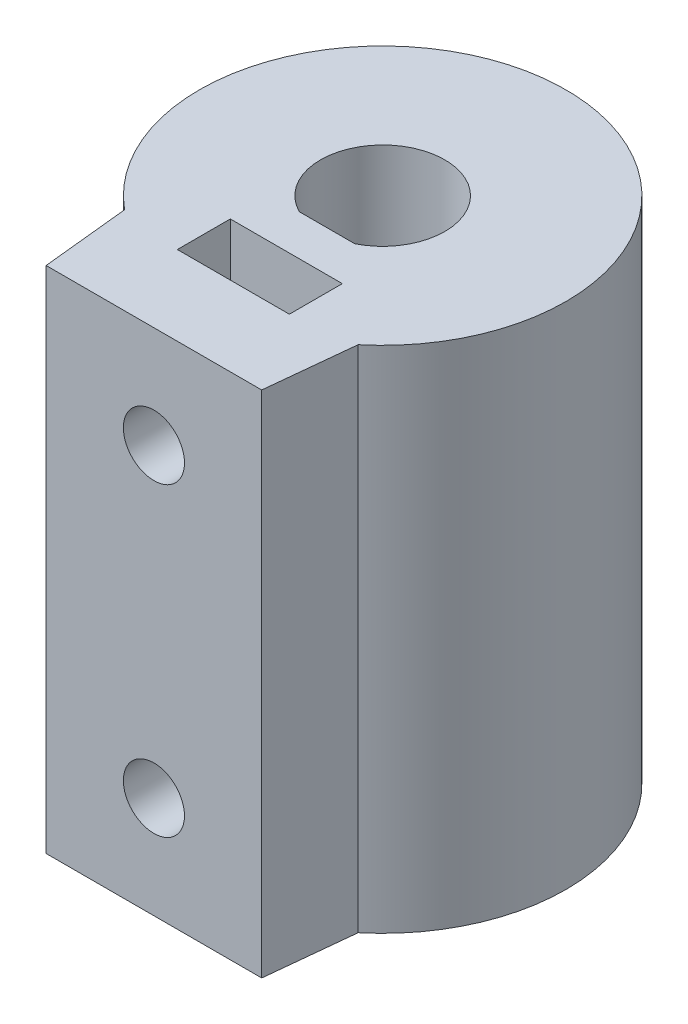
ISO-10303-21;
HEADER;
FILE_DESCRIPTION(('STEP AP214'),'2;1');
FILE_NAME('part.step','',(''),(''),'','','');
FILE_SCHEMA(('AUTOMOTIVE_DESIGN { 1 0 10303 214 1 1 1 1 }'));
ENDSEC;
DATA;
#1=APPLICATION_CONTEXT('core data for automotive mechanical design processes');
#2=APPLICATION_PROTOCOL_DEFINITION('international standard','automotive_design',2000,#1);
#3=PRODUCT_CONTEXT('',#1,'mechanical');
#4=PRODUCT('Part','Part','',(#3));
#5=PRODUCT_RELATED_PRODUCT_CATEGORY('part','',(#4));
#6=PRODUCT_DEFINITION_FORMATION('','',#4);
#7=PRODUCT_DEFINITION_CONTEXT('part definition',#1,'design');
#8=PRODUCT_DEFINITION('design','',#6,#7);
#9=PRODUCT_DEFINITION_SHAPE('','',#8);
#10=(LENGTH_UNIT() NAMED_UNIT(*) SI_UNIT(.MILLI.,.METRE.));
#11=(NAMED_UNIT(*) PLANE_ANGLE_UNIT() SI_UNIT($,.RADIAN.));
#12=(NAMED_UNIT(*) SI_UNIT($,.STERADIAN.) SOLID_ANGLE_UNIT());
#13=UNCERTAINTY_MEASURE_WITH_UNIT(LENGTH_MEASURE(1.E-05),#10,'distance_accuracy_value','');
#14=(GEOMETRIC_REPRESENTATION_CONTEXT(3) GLOBAL_UNCERTAINTY_ASSIGNED_CONTEXT((#13)) GLOBAL_UNIT_ASSIGNED_CONTEXT((#10,
#11,#12)) REPRESENTATION_CONTEXT('',''));
#15=CARTESIAN_POINT('',(0.,0.,0.));
#16=DIRECTION('',(0.,0.,1.));
#17=DIRECTION('',(1.,0.,0.));
#18=AXIS2_PLACEMENT_3D('',#15,#16,#17);
#19=CARTESIAN_POINT('',(0.,20.,-0.770000000000002));
#20=DIRECTION('',(0.,0.,1.));
#21=DIRECTION('',(1.,0.,0.));
#22=AXIS2_PLACEMENT_3D('',#19,#20,#21);
#23=CYLINDRICAL_SURFACE('',#22,1.5);
#24=CARTESIAN_POINT('',(0.,20.,4.73));
#25=DIRECTION('',(0.,0.,1.));
#26=DIRECTION('',(1.,0.,0.));
#27=AXIS2_PLACEMENT_3D('',#24,#25,#26);
#28=CIRCLE('',#27,1.5);
#29=CARTESIAN_POINT('',(1.5,20.,4.73));
#30=VERTEX_POINT('',#29);
#31=EDGE_CURVE('E347',#30,#30,#28,.T.);
#32=ORIENTED_EDGE('',*,*,#31,.T.);
#33=EDGE_LOOP('',(#32));
#34=FACE_BOUND('',#33,.T.);
#35=CARTESIAN_POINT('',(0.,20.,2.73));
#36=DIRECTION('',(0.,0.,-1.));
#37=DIRECTION('',(-1.,0.,0.));
#38=AXIS2_PLACEMENT_3D('',#35,#36,#37);
#39=CIRCLE('',#38,1.5);
#40=CARTESIAN_POINT('',(-1.36,19.3672283192177,2.73));
#41=VERTEX_POINT('',#40);
#42=CARTESIAN_POINT('',(1.36,19.3672283192177,2.73));
#43=VERTEX_POINT('',#42);
#44=EDGE_CURVE('E256',#41,#43,#39,.F.);
#45=ORIENTED_EDGE('',*,*,#44,.F.);
#46=CARTESIAN_POINT('',(-1.36,20.6327716807823,2.73));
#47=CARTESIAN_POINT('',(-1.37582693202637,20.5987516826467,2.72211426512571));
#48=CARTESIAN_POINT('',(-1.39041402763153,20.5640632935865,2.71467722365243));
#49=CARTESIAN_POINT('',(-1.41700490797706,20.4934805228224,2.70089282276826));
#50=CARTESIAN_POINT('',(-1.42900735559939,20.4575855279516,2.69454602771726));
#51=CARTESIAN_POINT('',(-1.46090336135237,20.3485325620071,2.67747143825815));
#52=CARTESIAN_POINT('',(-1.47677007370152,20.2738258520041,2.66866585744207));
#53=CARTESIAN_POINT('',(-1.49698728644416,20.1221126237164,2.657380257011));
#54=CARTESIAN_POINT('',(-1.50129267716343,20.0450982790909,2.65492501636061));
#55=CARTESIAN_POINT('',(-1.49803519614687,19.8914012459497,2.65676325665299));
#56=CARTESIAN_POINT('',(-1.49047482935579,19.8147184908599,2.66105531319426));
#57=CARTESIAN_POINT('',(-1.4657649565435,19.6746350688783,2.67473430540776));
#58=CARTESIAN_POINT('',(-1.45011016050553,19.6108807315012,2.68332165663147));
#59=CARTESIAN_POINT('',(-1.41086990654606,19.4864603830018,2.70414463478998));
#60=CARTESIAN_POINT('',(-1.38728303426965,19.425794924875,2.71638091231448));
#61=CARTESIAN_POINT('',(-1.36,19.3672283192177,2.73));
#62=B_SPLINE_CURVE_WITH_KNOTS('',3,(#46,#47,#48,#49,#50,#51,#52,#53,#54,#55,#56,#57,#58,#59,#60,
#61),.UNSPECIFIED.,.F.,.F.,(4,2,2,2,2,2,2,4),(0.,0.114968269489344,0.229995873478572,
0.459445569286955,0.689789234119177,0.920084278326595,1.11805841082691,1.31606786248918),.UNSPECIFIED.);
#63=CARTESIAN_POINT('',(-1.36,20.6327716807823,2.73));
#64=VERTEX_POINT('',#63);
#65=EDGE_CURVE('E220',#64,#41,#62,.T.);
#66=ORIENTED_EDGE('',*,*,#65,.F.);
#67=CARTESIAN_POINT('',(1.36,20.6327716807823,2.73));
#68=VERTEX_POINT('',#67);
#69=EDGE_CURVE('E230',#68,#64,#39,.F.);
#70=ORIENTED_EDGE('',*,*,#69,.F.);
#71=CARTESIAN_POINT('',(1.36,19.3672283192177,2.73));
#72=CARTESIAN_POINT('',(1.37582693202637,19.4012483173533,2.72211426512571));
#73=CARTESIAN_POINT('',(1.39041402763153,19.4359367064135,2.71467722365243));
#74=CARTESIAN_POINT('',(1.41700490797706,19.5065194771776,2.70089282276826));
#75=CARTESIAN_POINT('',(1.42900735559939,19.5424144720484,2.69454602771726));
#76=CARTESIAN_POINT('',(1.46090336135237,19.6514674379929,2.67747143825815));
#77=CARTESIAN_POINT('',(1.47677007370153,19.7261741479959,2.66866585744207));
#78=CARTESIAN_POINT('',(1.49698728644416,19.8778873762836,2.657380257011));
#79=CARTESIAN_POINT('',(1.50129267716343,19.9549017209091,2.65492501636061));
#80=CARTESIAN_POINT('',(1.49803519614687,20.1085987540503,2.65676325665299));
#81=CARTESIAN_POINT('',(1.49047482935579,20.1852815091401,2.66105531319426));
#82=CARTESIAN_POINT('',(1.4657649565435,20.3253649311217,2.67473430540776));
#83=CARTESIAN_POINT('',(1.45011016050552,20.3891192684988,2.68332165663147));
#84=CARTESIAN_POINT('',(1.41086990654606,20.5135396169982,2.70414463478998));
#85=CARTESIAN_POINT('',(1.38728303426965,20.574205075125,2.71638091231448));
#86=CARTESIAN_POINT('',(1.36,20.6327716807823,2.73));
#87=B_SPLINE_CURVE_WITH_KNOTS('',3,(#71,#72,#73,#74,#75,#76,#77,#78,#79,#80,#81,#82,#83,#84,#85,
#86),.UNSPECIFIED.,.F.,.F.,(4,2,2,2,2,2,2,4),(0.,0.114968269489344,0.229995873478572,
0.459445569286962,0.689789234119187,0.920084278326605,1.11805841082692,1.31606786248917),.UNSPECIFIED.);
#88=EDGE_CURVE('E249',#43,#68,#87,.T.);
#89=ORIENTED_EDGE('',*,*,#88,.F.);
#90=EDGE_LOOP('',(#45,#66,#70,#89));
#91=FACE_BOUND('',#90,.T.);
#92=ADVANCED_FACE('F37',(#34,#91),#23,.F.);
#93=CARTESIAN_POINT('',(0.,25.,0.));
#94=DIRECTION('',(0.,1.,0.));
#95=DIRECTION('',(0.,0.,1.));
#96=AXIS2_PLACEMENT_3D('',#93,#94,#95);
#97=PLANE('',#96);
#98=DIRECTION('',(-1.,0.,0.));
#99=VECTOR('',#98,1.);
#100=CARTESIAN_POINT('',(-5.25,25.,11.23));
#101=LINE('',#100,#99);
#102=CARTESIAN_POINT('',(5.29182838670146,25.,11.23));
#103=VERTEX_POINT('',#102);
#104=CARTESIAN_POINT('',(-5.29182838670146,25.,11.23));
#105=VERTEX_POINT('',#104);
#106=EDGE_CURVE('E51',#103,#105,#101,.T.);
#107=ORIENTED_EDGE('',*,*,#106,.F.);
#108=DIRECTION('',(0.102499756623053,0.,-0.994733029456756));
#109=VECTOR('',#108,1.);
#110=CARTESIAN_POINT('',(5.73421329875905,25.,6.93677142800127));
#111=LINE('',#110,#109);
#112=CARTESIAN_POINT('',(5.73421329875905,25.,6.93677142800127));
#113=VERTEX_POINT('',#112);
#114=EDGE_CURVE('E11',#103,#113,#111,.T.);
#115=ORIENTED_EDGE('',*,*,#114,.T.);
#116=CARTESIAN_POINT('',(0.,25.,0.));
#117=DIRECTION('',(0.,1.,0.));
#118=DIRECTION('',(0.,0.,-1.));
#119=AXIS2_PLACEMENT_3D('',#116,#117,#118);
#120=CIRCLE('',#119,9.);
#121=CARTESIAN_POINT('',(-5.73421329875905,25.,6.93677142800127));
#122=VERTEX_POINT('',#121);
#123=EDGE_CURVE('E409',#113,#122,#120,.T.);
#124=ORIENTED_EDGE('',*,*,#123,.T.);
#125=DIRECTION('',(0.102499756623053,0.,0.994733029456756));
#126=VECTOR('',#125,1.);
#127=CARTESIAN_POINT('',(-5.25,25.,11.6359334303968));
#128=LINE('',#127,#126);
#129=EDGE_CURVE('E393',#122,#105,#128,.T.);
#130=ORIENTED_EDGE('',*,*,#129,.T.);
#131=EDGE_LOOP('',(#107,#115,#124,#130));
#132=FACE_BOUND('',#131,.T.);
#133=CARTESIAN_POINT('',(0.,25.,0.));
#134=DIRECTION('',(0.,1.,0.));
#135=DIRECTION('',(0.,0.,1.));
#136=AXIS2_PLACEMENT_3D('',#133,#134,#135);
#137=CIRCLE('',#136,3.05);
#138=CARTESIAN_POINT('',(1.36,25.,2.73));
#139=VERTEX_POINT('',#138);
#140=CARTESIAN_POINT('',(-1.36,25.,2.73));
#141=VERTEX_POINT('',#140);
#142=EDGE_CURVE('E365',#139,#141,#137,.T.);
#143=ORIENTED_EDGE('',*,*,#142,.F.);
#144=DIRECTION('',(1.,0.,0.));
#145=VECTOR('',#144,1.);
#146=CARTESIAN_POINT('',(-5.25,25.,2.73));
#147=LINE('',#146,#145);
#148=EDGE_CURVE('E517',#141,#139,#147,.T.);
#149=ORIENTED_EDGE('',*,*,#148,.F.);
#150=EDGE_LOOP('',(#143,#149));
#151=FACE_BOUND('',#150,.T.);
#152=DIRECTION('',(-1.,0.,0.));
#153=VECTOR('',#152,1.);
#154=CARTESIAN_POINT('',(-2.75,25.,7.33));
#155=LINE('',#154,#153);
#156=CARTESIAN_POINT('',(2.75,25.,7.33));
#157=VERTEX_POINT('',#156);
#158=CARTESIAN_POINT('',(-2.75,25.,7.33));
#159=VERTEX_POINT('',#158);
#160=EDGE_CURVE('E178',#157,#159,#155,.T.);
#161=ORIENTED_EDGE('',*,*,#160,.T.);
#162=DIRECTION('',(0.,0.,-1.));
#163=VECTOR('',#162,1.);
#164=CARTESIAN_POINT('',(-2.75,25.,7.33));
#165=LINE('',#164,#163);
#166=CARTESIAN_POINT('',(-2.75,25.,4.73));
#167=VERTEX_POINT('',#166);
#168=EDGE_CURVE('E190',#159,#167,#165,.T.);
#169=ORIENTED_EDGE('',*,*,#168,.T.);
#170=DIRECTION('',(1.,0.,0.));
#171=VECTOR('',#170,1.);
#172=CARTESIAN_POINT('',(-2.75,25.,4.73));
#173=LINE('',#172,#171);
#174=CARTESIAN_POINT('',(2.75,25.,4.73));
#175=VERTEX_POINT('',#174);
#176=EDGE_CURVE('E215',#167,#175,#173,.T.);
#177=ORIENTED_EDGE('',*,*,#176,.T.);
#178=DIRECTION('',(0.,0.,1.));
#179=VECTOR('',#178,1.);
#180=CARTESIAN_POINT('',(2.75,25.,7.33));
#181=LINE('',#180,#179);
#182=EDGE_CURVE('E213',#175,#157,#181,.T.);
#183=ORIENTED_EDGE('',*,*,#182,.T.);
#184=EDGE_LOOP('',(#161,#169,#177,#183));
#185=FACE_BOUND('',#184,.T.);
#186=ADVANCED_FACE('F242',(#132,#151,#185),#97,.T.);
#187=CARTESIAN_POINT('',(0.,20.,7.33));
#188=DIRECTION('',(0.,0.,-1.));
#189=DIRECTION('',(-1.,0.,0.));
#190=AXIS2_PLACEMENT_3D('',#187,#188,#189);
#191=CIRCLE('',#190,1.5);
#192=CARTESIAN_POINT('',(-1.5,20.,7.33));
#193=VERTEX_POINT('',#192);
#194=EDGE_CURVE('E380',#193,#193,#191,.T.);
#195=ORIENTED_EDGE('',*,*,#194,.T.);
#196=EDGE_LOOP('',(#195));
#197=FACE_BOUND('',#196,.T.);
#198=CARTESIAN_POINT('',(0.,20.,11.23));
#199=DIRECTION('',(0.,0.,1.));
#200=DIRECTION('',(1.,0.,0.));
#201=AXIS2_PLACEMENT_3D('',#198,#199,#200);
#202=CIRCLE('',#201,1.5);
#203=CARTESIAN_POINT('',(1.5,20.,11.23));
#204=VERTEX_POINT('',#203);
#205=EDGE_CURVE('E419',#204,#204,#202,.T.);
#206=ORIENTED_EDGE('',*,*,#205,.T.);
#207=EDGE_LOOP('',(#206));
#208=FACE_BOUND('',#207,.T.);
#209=ADVANCED_FACE('F236',(#197,#208),#23,.F.);
#210=CARTESIAN_POINT('',(-2.32904237417776,12.,2.73));
#211=DIRECTION('',(0.,0.,-1.));
#212=DIRECTION('',(-1.,0.,0.));
#213=AXIS2_PLACEMENT_3D('',#210,#211,#212);
#214=PLANE('',#213);
#215=DIRECTION('',(0.,-1.,0.));
#216=VECTOR('',#215,1.);
#217=CARTESIAN_POINT('',(-1.36,25.,2.73));
#218=LINE('',#217,#216);
#219=CARTESIAN_POINT('',(-1.36,5.63277168078226,2.73));
#220=VERTEX_POINT('',#219);
#221=EDGE_CURVE('E356',#220,#41,#218,.F.);
#222=ORIENTED_EDGE('',*,*,#221,.T.);
#223=ORIENTED_EDGE('',*,*,#44,.T.);
#224=DIRECTION('',(0.,-1.,0.));
#225=VECTOR('',#224,1.);
#226=CARTESIAN_POINT('',(1.36,25.,2.73));
#227=LINE('',#226,#225);
#228=CARTESIAN_POINT('',(1.36,5.63277168078226,2.73));
#229=VERTEX_POINT('',#228);
#230=EDGE_CURVE('E374',#43,#229,#227,.T.);
#231=ORIENTED_EDGE('',*,*,#230,.T.);
#232=CARTESIAN_POINT('',(0.,5.,2.73));
#233=DIRECTION('',(0.,0.,-1.));
#234=DIRECTION('',(-1.,0.,0.));
#235=AXIS2_PLACEMENT_3D('',#232,#233,#234);
#236=CIRCLE('',#235,1.5);
#237=EDGE_CURVE('E299',#220,#229,#236,.T.);
#238=ORIENTED_EDGE('',*,*,#237,.F.);
#239=EDGE_LOOP('',(#222,#223,#231,#238));
#240=FACE_BOUND('',#239,.T.);
#241=ADVANCED_FACE('F241',(#240),#214,.T.);
#242=CARTESIAN_POINT('',(0.,25.,0.));
#243=DIRECTION('',(0.,-1.,0.));
#244=DIRECTION('',(0.,0.,-1.));
#245=AXIS2_PLACEMENT_3D('',#242,#243,#244);
#246=CYLINDRICAL_SURFACE('',#245,3.05);
#247=ORIENTED_EDGE('',*,*,#230,.F.);
#248=ORIENTED_EDGE('',*,*,#88,.T.);
#249=EDGE_CURVE('E370',#139,#68,#227,.T.);
#250=ORIENTED_EDGE('',*,*,#249,.F.);
#251=ORIENTED_EDGE('',*,*,#142,.T.);
#252=EDGE_CURVE('E358',#64,#141,#218,.F.);
#253=ORIENTED_EDGE('',*,*,#252,.F.);
#254=ORIENTED_EDGE('',*,*,#65,.T.);
#255=ORIENTED_EDGE('',*,*,#221,.F.);
#256=CARTESIAN_POINT('',(-1.36,4.36722831921774,2.73));
#257=CARTESIAN_POINT('',(-1.37582693202637,4.40124831735328,2.72211426512571));
#258=CARTESIAN_POINT('',(-1.39041402763153,4.43593670641346,2.71467722365243));
#259=CARTESIAN_POINT('',(-1.41700490797706,4.50651947717757,2.70089282276826));
#260=CARTESIAN_POINT('',(-1.42900735559939,4.54241447204839,2.69454602771726));
#261=CARTESIAN_POINT('',(-1.46090336135237,4.65146743799289,2.67747143825815));
#262=CARTESIAN_POINT('',(-1.47677007370152,4.72617414799588,2.66866585744207));
#263=CARTESIAN_POINT('',(-1.49698728644416,4.87788737628362,2.657380257011));
#264=CARTESIAN_POINT('',(-1.50129267716343,4.95490172090914,2.65492501636061));
#265=CARTESIAN_POINT('',(-1.49803519614687,5.10859875405029,2.65676325665299));
#266=CARTESIAN_POINT('',(-1.49047482935579,5.18528150914013,2.66105531319426));
#267=CARTESIAN_POINT('',(-1.4657649565435,5.32536493112172,2.67473430540776));
#268=CARTESIAN_POINT('',(-1.45011016050552,5.38911926849878,2.68332165663147));
#269=CARTESIAN_POINT('',(-1.41086990654606,5.51353961699819,2.70414463478998));
#270=CARTESIAN_POINT('',(-1.38728303426965,5.57420507512498,2.71638091231448));
#271=CARTESIAN_POINT('',(-1.36,5.63277168078226,2.73));
#272=B_SPLINE_CURVE_WITH_KNOTS('',3,(#256,#257,#258,#259,#260,#261,#262,#263,#264,#265,#266,
#267,#268,#269,#270,#271),.UNSPECIFIED.,.F.,.F.,(4,2,2,2,2,2,2,4),(0.,0.114968269489347,
0.229995873478574,0.459445569286958,0.689789234119182,0.920084278326603,1.11805841082691,
1.31606786248917),.UNSPECIFIED.);
#273=CARTESIAN_POINT('',(-1.36,4.36722831921774,2.73));
#274=VERTEX_POINT('',#273);
#275=EDGE_CURVE('E298',#274,#220,#272,.T.);
#276=ORIENTED_EDGE('',*,*,#275,.F.);
#277=CARTESIAN_POINT('',(-1.36,0.,2.73));
#278=VERTEX_POINT('',#277);
#279=EDGE_CURVE('E361',#278,#274,#218,.F.);
#280=ORIENTED_EDGE('',*,*,#279,.F.);
#281=CARTESIAN_POINT('',(0.,0.,0.));
#282=DIRECTION('',(0.,1.,0.));
#283=DIRECTION('',(0.,0.,1.));
#284=AXIS2_PLACEMENT_3D('',#281,#282,#283);
#285=CIRCLE('',#284,3.05);
#286=CARTESIAN_POINT('',(1.36,0.,2.73));
#287=VERTEX_POINT('',#286);
#288=EDGE_CURVE('E368',#287,#278,#285,.T.);
#289=ORIENTED_EDGE('',*,*,#288,.F.);
#290=CARTESIAN_POINT('',(1.36,4.36722831921774,2.73));
#291=VERTEX_POINT('',#290);
#292=EDGE_CURVE('E364',#291,#287,#227,.T.);
#293=ORIENTED_EDGE('',*,*,#292,.F.);
#294=CARTESIAN_POINT('',(1.36,5.63277168078226,2.73));
#295=CARTESIAN_POINT('',(1.37582693202637,5.59875168264672,2.72211426512571));
#296=CARTESIAN_POINT('',(1.39041402763153,5.56406329358655,2.71467722365243));
#297=CARTESIAN_POINT('',(1.41700490797706,5.49348052282243,2.70089282276826));
#298=CARTESIAN_POINT('',(1.42900735559939,5.45758552795162,2.69454602771726));
#299=CARTESIAN_POINT('',(1.46090336135237,5.34853256200711,2.67747143825815));
#300=CARTESIAN_POINT('',(1.47677007370152,5.27382585200412,2.66866585744207));
#301=CARTESIAN_POINT('',(1.49698728644416,5.12211262371638,2.657380257011));
#302=CARTESIAN_POINT('',(1.50129267716343,5.04509827909086,2.65492501636061));
#303=CARTESIAN_POINT('',(1.49803519614687,4.89140124594971,2.65676325665299));
#304=CARTESIAN_POINT('',(1.49047482935579,4.81471849085987,2.66105531319426));
#305=CARTESIAN_POINT('',(1.4657649565435,4.67463506887828,2.67473430540776));
#306=CARTESIAN_POINT('',(1.45011016050552,4.61088073150122,2.68332165663147));
#307=CARTESIAN_POINT('',(1.41086990654606,4.48646038300181,2.70414463478998));
#308=CARTESIAN_POINT('',(1.38728303426965,4.42579492487502,2.71638091231448));
#309=CARTESIAN_POINT('',(1.36,4.36722831921774,2.73));
#310=B_SPLINE_CURVE_WITH_KNOTS('',3,(#294,#295,#296,#297,#298,#299,#300,#301,#302,#303,#304,
#305,#306,#307,#308,#309),.UNSPECIFIED.,.F.,.F.,(4,2,2,2,2,2,2,4),(0.,0.114968269489346,
0.229995873478574,0.459445569286958,0.689789234119184,0.920084278326602,1.11805841082692,
1.31606786248917),.UNSPECIFIED.);
#311=EDGE_CURVE('E305',#229,#291,#310,.T.);
#312=ORIENTED_EDGE('',*,*,#311,.F.);
#313=EDGE_LOOP('',(#247,#248,#250,#251,#253,#254,#255,#276,#280,#289,#293,#312));
#314=FACE_BOUND('',#313,.T.);
#315=ADVANCED_FACE('F232',(#314),#246,.F.);
#316=CARTESIAN_POINT('',(0.,5.,-0.770000000000002));
#317=DIRECTION('',(0.,0.,1.));
#318=DIRECTION('',(1.,0.,0.));
#319=AXIS2_PLACEMENT_3D('',#316,#317,#318);
#320=CYLINDRICAL_SURFACE('',#319,1.5);
#321=CARTESIAN_POINT('',(0.,5.,7.33));
#322=DIRECTION('',(0.,0.,1.));
#323=DIRECTION('',(1.,0.,0.));
#324=AXIS2_PLACEMENT_3D('',#321,#322,#323);
#325=CIRCLE('',#324,1.5);
#326=CARTESIAN_POINT('',(1.5,5.,7.33));
#327=VERTEX_POINT('',#326);
#328=EDGE_CURVE('E377',#327,#327,#325,.F.);
#329=ORIENTED_EDGE('',*,*,#328,.T.);
#330=EDGE_LOOP('',(#329));
#331=FACE_BOUND('',#330,.T.);
#332=CARTESIAN_POINT('',(0.,5.,11.23));
#333=DIRECTION('',(0.,0.,1.));
#334=DIRECTION('',(1.,0.,0.));
#335=AXIS2_PLACEMENT_3D('',#332,#333,#334);
#336=CIRCLE('',#335,1.5);
#337=CARTESIAN_POINT('',(1.5,5.,11.23));
#338=VERTEX_POINT('',#337);
#339=EDGE_CURVE('E415',#338,#338,#336,.T.);
#340=ORIENTED_EDGE('',*,*,#339,.T.);
#341=EDGE_LOOP('',(#340));
#342=FACE_BOUND('',#341,.T.);
#343=ADVANCED_FACE('F315',(#331,#342),#320,.F.);
#344=ORIENTED_EDGE('',*,*,#237,.T.);
#345=ORIENTED_EDGE('',*,*,#311,.T.);
#346=EDGE_CURVE('E291',#291,#274,#236,.T.);
#347=ORIENTED_EDGE('',*,*,#346,.T.);
#348=ORIENTED_EDGE('',*,*,#275,.T.);
#349=EDGE_LOOP('',(#344,#345,#347,#348));
#350=FACE_BOUND('',#349,.T.);
#351=CARTESIAN_POINT('',(0.,5.,4.73));
#352=DIRECTION('',(0.,0.,-1.));
#353=DIRECTION('',(-1.,0.,0.));
#354=AXIS2_PLACEMENT_3D('',#351,#352,#353);
#355=CIRCLE('',#354,1.5);
#356=CARTESIAN_POINT('',(-1.5,5.,4.73));
#357=VERTEX_POINT('',#356);
#358=EDGE_CURVE('E373',#357,#357,#355,.F.);
#359=ORIENTED_EDGE('',*,*,#358,.T.);
#360=EDGE_LOOP('',(#359));
#361=FACE_BOUND('',#360,.T.);
#362=ADVANCED_FACE('F310',(#350,#361),#320,.F.);
#363=ORIENTED_EDGE('',*,*,#249,.T.);
#364=ORIENTED_EDGE('',*,*,#69,.T.);
#365=ORIENTED_EDGE('',*,*,#252,.T.);
#366=ORIENTED_EDGE('',*,*,#148,.T.);
#367=EDGE_LOOP('',(#363,#364,#365,#366));
#368=FACE_BOUND('',#367,.T.);
#369=ADVANCED_FACE('F314',(#368),#214,.T.);
#370=CARTESIAN_POINT('',(0.,0.,0.));
#371=DIRECTION('',(0.,1.,0.));
#372=DIRECTION('',(0.,0.,1.));
#373=AXIS2_PLACEMENT_3D('',#370,#371,#372);
#374=PLANE('',#373);
#375=DIRECTION('',(1.,0.,0.));
#376=VECTOR('',#375,1.);
#377=CARTESIAN_POINT('',(-2.75,0.,4.73));
#378=LINE('',#377,#376);
#379=CARTESIAN_POINT('',(-2.75,0.,4.73));
#380=VERTEX_POINT('',#379);
#381=CARTESIAN_POINT('',(2.75,0.,4.73));
#382=VERTEX_POINT('',#381);
#383=EDGE_CURVE('E279',#380,#382,#378,.T.);
#384=ORIENTED_EDGE('',*,*,#383,.F.);
#385=DIRECTION('',(0.,0.,-1.));
#386=VECTOR('',#385,1.);
#387=CARTESIAN_POINT('',(-2.75,0.,7.33));
#388=LINE('',#387,#386);
#389=CARTESIAN_POINT('',(-2.75,0.,7.33));
#390=VERTEX_POINT('',#389);
#391=EDGE_CURVE('E269',#390,#380,#388,.T.);
#392=ORIENTED_EDGE('',*,*,#391,.F.);
#393=DIRECTION('',(-1.,0.,0.));
#394=VECTOR('',#393,1.);
#395=CARTESIAN_POINT('',(-2.75,0.,7.33));
#396=LINE('',#395,#394);
#397=CARTESIAN_POINT('',(2.75,0.,7.33));
#398=VERTEX_POINT('',#397);
#399=EDGE_CURVE('E285',#398,#390,#396,.T.);
#400=ORIENTED_EDGE('',*,*,#399,.F.);
#401=DIRECTION('',(0.,0.,1.));
#402=VECTOR('',#401,1.);
#403=CARTESIAN_POINT('',(2.75,0.,7.33));
#404=LINE('',#403,#402);
#405=EDGE_CURVE('E282',#382,#398,#404,.T.);
#406=ORIENTED_EDGE('',*,*,#405,.F.);
#407=EDGE_LOOP('',(#384,#392,#400,#406));
#408=FACE_BOUND('',#407,.T.);
#409=DIRECTION('',(1.,0.,0.));
#410=VECTOR('',#409,1.);
#411=CARTESIAN_POINT('',(-5.25,0.,11.23));
#412=LINE('',#411,#410);
#413=CARTESIAN_POINT('',(-5.29182838670146,0.,11.23));
#414=VERTEX_POINT('',#413);
#415=CARTESIAN_POINT('',(5.29182838670146,0.,11.23));
#416=VERTEX_POINT('',#415);
#417=EDGE_CURVE('E200',#414,#416,#412,.T.);
#418=ORIENTED_EDGE('',*,*,#417,.F.);
#419=DIRECTION('',(-0.102499756623053,0.,-0.994733029456756));
#420=VECTOR('',#419,1.);
#421=CARTESIAN_POINT('',(-6.38124098188882,0.,0.657538885537824));
#422=LINE('',#421,#420);
#423=CARTESIAN_POINT('',(-5.73421329875905,0.,6.93677142800127));
#424=VERTEX_POINT('',#423);
#425=EDGE_CURVE('E390',#414,#424,#422,.T.);
#426=ORIENTED_EDGE('',*,*,#425,.T.);
#427=CARTESIAN_POINT('',(0.,0.,0.));
#428=DIRECTION('',(0.,1.,0.));
#429=DIRECTION('',(0.,0.,-1.));
#430=AXIS2_PLACEMENT_3D('',#427,#428,#429);
#431=CIRCLE('',#430,9.);
#432=CARTESIAN_POINT('',(5.73421329875905,0.,6.93677142800127));
#433=VERTEX_POINT('',#432);
#434=EDGE_CURVE('E416',#433,#424,#431,.T.);
#435=ORIENTED_EDGE('',*,*,#434,.F.);
#436=DIRECTION('',(-0.102499756623053,0.,0.994733029456756));
#437=VECTOR('',#436,1.);
#438=CARTESIAN_POINT('',(6.38124098188882,0.,0.657538885537823));
#439=LINE('',#438,#437);
#440=EDGE_CURVE('E398',#433,#416,#439,.T.);
#441=ORIENTED_EDGE('',*,*,#440,.T.);
#442=EDGE_LOOP('',(#418,#426,#435,#441));
#443=FACE_BOUND('',#442,.T.);
#444=DIRECTION('',(1.,0.,0.));
#445=VECTOR('',#444,1.);
#446=CARTESIAN_POINT('',(-2.32904237417776,0.,2.73));
#447=LINE('',#446,#445);
#448=EDGE_CURVE('E514',#278,#287,#447,.T.);
#449=ORIENTED_EDGE('',*,*,#448,.T.);
#450=ORIENTED_EDGE('',*,*,#288,.T.);
#451=EDGE_LOOP('',(#449,#450));
#452=FACE_BOUND('',#451,.T.);
#453=ADVANCED_FACE('F323',(#408,#443,#452),#374,.F.);
#454=ORIENTED_EDGE('',*,*,#346,.F.);
#455=ORIENTED_EDGE('',*,*,#292,.T.);
#456=ORIENTED_EDGE('',*,*,#448,.F.);
#457=ORIENTED_EDGE('',*,*,#279,.T.);
#458=EDGE_LOOP('',(#454,#455,#456,#457));
#459=FACE_BOUND('',#458,.T.);
#460=ADVANCED_FACE('F319',(#459),#214,.T.);
#461=CARTESIAN_POINT('',(-2.75,5.,7.33));
#462=DIRECTION('',(0.,0.,1.));
#463=DIRECTION('',(1.,0.,0.));
#464=AXIS2_PLACEMENT_3D('',#461,#462,#463);
#465=PLANE('',#464);
#466=ORIENTED_EDGE('',*,*,#328,.F.);
#467=EDGE_LOOP('',(#466));
#468=FACE_BOUND('',#467,.T.);
#469=DIRECTION('',(0.,-1.,0.));
#470=VECTOR('',#469,1.);
#471=CARTESIAN_POINT('',(2.75,5.,7.33));
#472=LINE('',#471,#470);
#473=CARTESIAN_POINT('',(2.75,7.08771324027147,7.33));
#474=VERTEX_POINT('',#473);
#475=EDGE_CURVE('E292',#474,#398,#472,.T.);
#476=ORIENTED_EDGE('',*,*,#475,.T.);
#477=ORIENTED_EDGE('',*,*,#399,.T.);
#478=DIRECTION('',(0.,-1.,0.));
#479=VECTOR('',#478,1.);
#480=CARTESIAN_POINT('',(-2.75,5.,7.33));
#481=LINE('',#480,#479);
#482=CARTESIAN_POINT('',(-2.75,7.08771324027147,7.33));
#483=VERTEX_POINT('',#482);
#484=EDGE_CURVE('E289',#483,#390,#481,.T.);
#485=ORIENTED_EDGE('',*,*,#484,.F.);
#486=DIRECTION('',(0.866025403784438,0.500000000000001,0.));
#487=VECTOR('',#486,1.);
#488=CARTESIAN_POINT('',(0.,8.67542648054295,7.33));
#489=LINE('',#488,#487);
#490=CARTESIAN_POINT('',(0.,8.67542648054295,7.33));
#491=VERTEX_POINT('',#490);
#492=EDGE_CURVE('E257',#483,#491,#489,.T.);
#493=ORIENTED_EDGE('',*,*,#492,.T.);
#494=DIRECTION('',(0.866025403784438,-0.500000000000001,0.));
#495=VECTOR('',#494,1.);
#496=CARTESIAN_POINT('',(2.75,7.08771324027147,7.33));
#497=LINE('',#496,#495);
#498=EDGE_CURVE('E262',#491,#474,#497,.T.);
#499=ORIENTED_EDGE('',*,*,#498,.T.);
#500=EDGE_LOOP('',(#476,#477,#485,#493,#499));
#501=FACE_BOUND('',#500,.T.);
#502=ADVANCED_FACE('F322',(#468,#501),#465,.F.);
#503=CARTESIAN_POINT('',(-2.75,5.,4.73));
#504=DIRECTION('',(0.,0.,-1.));
#505=DIRECTION('',(-1.,0.,0.));
#506=AXIS2_PLACEMENT_3D('',#503,#504,#505);
#507=PLANE('',#506);
#508=ORIENTED_EDGE('',*,*,#383,.T.);
#509=DIRECTION('',(0.,-1.,0.));
#510=VECTOR('',#509,1.);
#511=CARTESIAN_POINT('',(2.75,5.,4.73));
#512=LINE('',#511,#510);
#513=CARTESIAN_POINT('',(2.75,7.08771324027147,4.73));
#514=VERTEX_POINT('',#513);
#515=EDGE_CURVE('E294',#514,#382,#512,.T.);
#516=ORIENTED_EDGE('',*,*,#515,.F.);
#517=DIRECTION('',(0.866025403784438,-0.500000000000001,0.));
#518=VECTOR('',#517,1.);
#519=CARTESIAN_POINT('',(2.75,7.08771324027147,4.73));
#520=LINE('',#519,#518);
#521=CARTESIAN_POINT('',(0.,8.67542648054295,4.73));
#522=VERTEX_POINT('',#521);
#523=EDGE_CURVE('E266',#522,#514,#520,.T.);
#524=ORIENTED_EDGE('',*,*,#523,.F.);
#525=DIRECTION('',(0.866025403784438,0.500000000000001,0.));
#526=VECTOR('',#525,1.);
#527=CARTESIAN_POINT('',(0.,8.67542648054295,4.73));
#528=LINE('',#527,#526);
#529=CARTESIAN_POINT('',(-2.75,7.08771324027147,4.72999999999999));
#530=VERTEX_POINT('',#529);
#531=EDGE_CURVE('E260',#530,#522,#528,.T.);
#532=ORIENTED_EDGE('',*,*,#531,.F.);
#533=DIRECTION('',(0.,-1.,0.));
#534=VECTOR('',#533,1.);
#535=CARTESIAN_POINT('',(-2.75,5.,4.73));
#536=LINE('',#535,#534);
#537=EDGE_CURVE('E288',#530,#380,#536,.T.);
#538=ORIENTED_EDGE('',*,*,#537,.T.);
#539=EDGE_LOOP('',(#508,#516,#524,#532,#538));
#540=FACE_BOUND('',#539,.T.);
#541=ORIENTED_EDGE('',*,*,#358,.F.);
#542=EDGE_LOOP('',(#541));
#543=FACE_BOUND('',#542,.T.);
#544=ADVANCED_FACE('F329',(#540,#543),#507,.F.);
#545=CARTESIAN_POINT('',(-2.75,5.,7.33));
#546=DIRECTION('',(-1.,0.,0.));
#547=DIRECTION('',(0.,0.,1.));
#548=AXIS2_PLACEMENT_3D('',#545,#546,#547);
#549=PLANE('',#548);
#550=ORIENTED_EDGE('',*,*,#484,.T.);
#551=ORIENTED_EDGE('',*,*,#391,.T.);
#552=ORIENTED_EDGE('',*,*,#537,.F.);
#553=DIRECTION('',(0.,0.,1.));
#554=VECTOR('',#553,1.);
#555=CARTESIAN_POINT('',(-2.75,7.08771324027147,-4.05545310695011));
#556=LINE('',#555,#554);
#557=EDGE_CURVE('E261',#530,#483,#556,.T.);
#558=ORIENTED_EDGE('',*,*,#557,.T.);
#559=EDGE_LOOP('',(#550,#551,#552,#558));
#560=FACE_BOUND('',#559,.T.);
#561=ADVANCED_FACE('F317',(#560),#549,.F.);
#562=CARTESIAN_POINT('',(2.75,5.,7.33));
#563=DIRECTION('',(1.,0.,0.));
#564=DIRECTION('',(0.,0.,-1.));
#565=AXIS2_PLACEMENT_3D('',#562,#563,#564);
#566=PLANE('',#565);
#567=ORIENTED_EDGE('',*,*,#515,.T.);
#568=ORIENTED_EDGE('',*,*,#405,.T.);
#569=ORIENTED_EDGE('',*,*,#475,.F.);
#570=DIRECTION('',(0.,0.,1.));
#571=VECTOR('',#570,1.);
#572=CARTESIAN_POINT('',(2.75,7.08771324027147,-4.0554531069501));
#573=LINE('',#572,#571);
#574=EDGE_CURVE('E265',#514,#474,#573,.T.);
#575=ORIENTED_EDGE('',*,*,#574,.F.);
#576=EDGE_LOOP('',(#567,#568,#569,#575));
#577=FACE_BOUND('',#576,.T.);
#578=ADVANCED_FACE('F541',(#577),#566,.F.);
#579=CARTESIAN_POINT('',(2.75,7.08771324027147,-4.0554531069501));
#580=DIRECTION('',(-0.500000000000001,-0.866025403784438,0.));
#581=DIRECTION('',(0.866025403784438,-0.500000000000001,0.));
#582=AXIS2_PLACEMENT_3D('',#579,#580,#581);
#583=PLANE('',#582);
#584=ORIENTED_EDGE('',*,*,#523,.T.);
#585=ORIENTED_EDGE('',*,*,#574,.T.);
#586=ORIENTED_EDGE('',*,*,#498,.F.);
#587=DIRECTION('',(0.,0.,1.));
#588=VECTOR('',#587,1.);
#589=CARTESIAN_POINT('',(0.,8.67542648054295,-4.0554531069501));
#590=LINE('',#589,#588);
#591=EDGE_CURVE('E255',#522,#491,#590,.T.);
#592=ORIENTED_EDGE('',*,*,#591,.F.);
#593=EDGE_LOOP('',(#584,#585,#586,#592));
#594=FACE_BOUND('',#593,.T.);
#595=ADVANCED_FACE('F536',(#594),#583,.T.);
#596=CARTESIAN_POINT('',(0.,8.67542648054295,-4.0554531069501));
#597=DIRECTION('',(0.5,-0.866025403784438,0.));
#598=DIRECTION('',(0.866025403784438,0.500000000000001,0.));
#599=AXIS2_PLACEMENT_3D('',#596,#597,#598);
#600=PLANE('',#599);
#601=ORIENTED_EDGE('',*,*,#531,.T.);
#602=ORIENTED_EDGE('',*,*,#591,.T.);
#603=ORIENTED_EDGE('',*,*,#492,.F.);
#604=ORIENTED_EDGE('',*,*,#557,.F.);
#605=EDGE_LOOP('',(#601,#602,#603,#604));
#606=FACE_BOUND('',#605,.T.);
#607=ADVANCED_FACE('F246',(#606),#600,.T.);
#608=CARTESIAN_POINT('',(-2.75,20.,7.33));
#609=DIRECTION('',(1.,0.,0.));
#610=DIRECTION('',(0.,0.,-1.));
#611=AXIS2_PLACEMENT_3D('',#608,#609,#610);
#612=PLANE('',#611);
#613=ORIENTED_EDGE('',*,*,#168,.F.);
#614=DIRECTION('',(0.,1.,0.));
#615=VECTOR('',#614,1.);
#616=CARTESIAN_POINT('',(-2.75,20.,7.33));
#617=LINE('',#616,#615);
#618=CARTESIAN_POINT('',(-2.75,17.9122867597285,7.33));
#619=VERTEX_POINT('',#618);
#620=EDGE_CURVE('E183',#619,#159,#617,.T.);
#621=ORIENTED_EDGE('',*,*,#620,.F.);
#622=DIRECTION('',(0.,0.,1.));
#623=VECTOR('',#622,1.);
#624=CARTESIAN_POINT('',(-2.75,17.9122867597285,-4.05545310695011));
#625=LINE('',#624,#623);
#626=CARTESIAN_POINT('',(-2.75,17.9122867597285,4.73));
#627=VERTEX_POINT('',#626);
#628=EDGE_CURVE('E198',#627,#619,#625,.T.);
#629=ORIENTED_EDGE('',*,*,#628,.F.);
#630=DIRECTION('',(0.,1.,0.));
#631=VECTOR('',#630,1.);
#632=CARTESIAN_POINT('',(-2.75,20.,4.73));
#633=LINE('',#632,#631);
#634=EDGE_CURVE('E218',#627,#167,#633,.T.);
#635=ORIENTED_EDGE('',*,*,#634,.T.);
#636=EDGE_LOOP('',(#613,#621,#629,#635));
#637=FACE_BOUND('',#636,.T.);
#638=ADVANCED_FACE('F244',(#637),#612,.T.);
#639=CARTESIAN_POINT('',(-2.75,20.,4.73));
#640=DIRECTION('',(0.,0.,1.));
#641=DIRECTION('',(1.,0.,0.));
#642=AXIS2_PLACEMENT_3D('',#639,#640,#641);
#643=PLANE('',#642);
#644=ORIENTED_EDGE('',*,*,#31,.F.);
#645=EDGE_LOOP('',(#644));
#646=FACE_BOUND('',#645,.T.);
#647=DIRECTION('',(0.,1.,0.));
#648=VECTOR('',#647,1.);
#649=CARTESIAN_POINT('',(2.75,20.,4.73));
#650=LINE('',#649,#648);
#651=CARTESIAN_POINT('',(2.75,17.9122867597285,4.73));
#652=VERTEX_POINT('',#651);
#653=EDGE_CURVE('E182',#652,#175,#650,.T.);
#654=ORIENTED_EDGE('',*,*,#653,.T.);
#655=ORIENTED_EDGE('',*,*,#176,.F.);
#656=ORIENTED_EDGE('',*,*,#634,.F.);
#657=DIRECTION('',(0.866025403784438,-0.500000000000001,0.));
#658=VECTOR('',#657,1.);
#659=CARTESIAN_POINT('',(0.,16.3245735194571,4.73));
#660=LINE('',#659,#658);
#661=CARTESIAN_POINT('',(0.,16.3245735194571,4.73));
#662=VERTEX_POINT('',#661);
#663=EDGE_CURVE('E204',#627,#662,#660,.T.);
#664=ORIENTED_EDGE('',*,*,#663,.T.);
#665=DIRECTION('',(0.866025403784438,0.500000000000001,0.));
#666=VECTOR('',#665,1.);
#667=CARTESIAN_POINT('',(2.75,17.9122867597285,4.73));
#668=LINE('',#667,#666);
#669=EDGE_CURVE('E191',#662,#652,#668,.T.);
#670=ORIENTED_EDGE('',*,*,#669,.T.);
#671=EDGE_LOOP('',(#654,#655,#656,#664,#670));
#672=FACE_BOUND('',#671,.T.);
#673=ADVANCED_FACE('F442',(#646,#672),#643,.T.);
#674=CARTESIAN_POINT('',(2.75,20.,7.33));
#675=DIRECTION('',(-1.,0.,0.));
#676=DIRECTION('',(0.,0.,1.));
#677=AXIS2_PLACEMENT_3D('',#674,#675,#676);
#678=PLANE('',#677);
#679=ORIENTED_EDGE('',*,*,#182,.F.);
#680=ORIENTED_EDGE('',*,*,#653,.F.);
#681=DIRECTION('',(0.,0.,1.));
#682=VECTOR('',#681,1.);
#683=CARTESIAN_POINT('',(2.75,17.9122867597285,-4.05545310695011));
#684=LINE('',#683,#682);
#685=CARTESIAN_POINT('',(2.75,17.9122867597285,7.33));
#686=VERTEX_POINT('',#685);
#687=EDGE_CURVE('E186',#652,#686,#684,.T.);
#688=ORIENTED_EDGE('',*,*,#687,.T.);
#689=DIRECTION('',(0.,1.,0.));
#690=VECTOR('',#689,1.);
#691=CARTESIAN_POINT('',(2.75,20.,7.33));
#692=LINE('',#691,#690);
#693=EDGE_CURVE('E169',#686,#157,#692,.T.);
#694=ORIENTED_EDGE('',*,*,#693,.T.);
#695=EDGE_LOOP('',(#679,#680,#688,#694));
#696=FACE_BOUND('',#695,.T.);
#697=ADVANCED_FACE('F187',(#696),#678,.T.);
#698=CARTESIAN_POINT('',(-2.75,20.,7.33));
#699=DIRECTION('',(0.,0.,-1.));
#700=DIRECTION('',(-1.,0.,0.));
#701=AXIS2_PLACEMENT_3D('',#698,#699,#700);
#702=PLANE('',#701);
#703=DIRECTION('',(0.866025403784438,-0.500000000000001,0.));
#704=VECTOR('',#703,1.);
#705=CARTESIAN_POINT('',(0.,16.3245735194571,7.33));
#706=LINE('',#705,#704);
#707=CARTESIAN_POINT('',(0.,16.3245735194571,7.33));
#708=VERTEX_POINT('',#707);
#709=EDGE_CURVE('E196',#619,#708,#706,.T.);
#710=ORIENTED_EDGE('',*,*,#709,.F.);
#711=ORIENTED_EDGE('',*,*,#620,.T.);
#712=ORIENTED_EDGE('',*,*,#160,.F.);
#713=ORIENTED_EDGE('',*,*,#693,.F.);
#714=DIRECTION('',(0.866025403784438,0.500000000000001,0.));
#715=VECTOR('',#714,1.);
#716=CARTESIAN_POINT('',(2.75,17.9122867597285,7.33));
#717=LINE('',#716,#715);
#718=EDGE_CURVE('E175',#708,#686,#717,.T.);
#719=ORIENTED_EDGE('',*,*,#718,.F.);
#720=EDGE_LOOP('',(#710,#711,#712,#713,#719));
#721=FACE_BOUND('',#720,.T.);
#722=ORIENTED_EDGE('',*,*,#194,.F.);
#723=EDGE_LOOP('',(#722));
#724=FACE_BOUND('',#723,.T.);
#725=ADVANCED_FACE('F172',(#721,#724),#702,.T.);
#726=CARTESIAN_POINT('',(0.,16.3245735194571,-4.05545310695011));
#727=DIRECTION('',(-0.500000000000001,-0.866025403784438,0.));
#728=DIRECTION('',(0.866025403784438,-0.500000000000001,0.));
#729=AXIS2_PLACEMENT_3D('',#726,#727,#728);
#730=PLANE('',#729);
#731=ORIENTED_EDGE('',*,*,#628,.T.);
#732=ORIENTED_EDGE('',*,*,#709,.T.);
#733=DIRECTION('',(0.,0.,1.));
#734=VECTOR('',#733,1.);
#735=CARTESIAN_POINT('',(0.,16.3245735194571,-4.05545310695011));
#736=LINE('',#735,#734);
#737=EDGE_CURVE('E195',#662,#708,#736,.T.);
#738=ORIENTED_EDGE('',*,*,#737,.F.);
#739=ORIENTED_EDGE('',*,*,#663,.F.);
#740=EDGE_LOOP('',(#731,#732,#738,#739));
#741=FACE_BOUND('',#740,.T.);
#742=ADVANCED_FACE('F436',(#741),#730,.F.);
#743=CARTESIAN_POINT('',(2.75,17.9122867597285,-4.05545310695011));
#744=DIRECTION('',(0.500000000000001,-0.866025403784438,0.));
#745=DIRECTION('',(0.866025403784438,0.500000000000001,0.));
#746=AXIS2_PLACEMENT_3D('',#743,#744,#745);
#747=PLANE('',#746);
#748=ORIENTED_EDGE('',*,*,#737,.T.);
#749=ORIENTED_EDGE('',*,*,#718,.T.);
#750=ORIENTED_EDGE('',*,*,#687,.F.);
#751=ORIENTED_EDGE('',*,*,#669,.F.);
#752=EDGE_LOOP('',(#748,#749,#750,#751));
#753=FACE_BOUND('',#752,.T.);
#754=ADVANCED_FACE('F193',(#753),#747,.F.);
#755=CARTESIAN_POINT('',(0.,0.,11.23));
#756=DIRECTION('',(0.,0.,1.));
#757=DIRECTION('',(1.,0.,0.));
#758=AXIS2_PLACEMENT_3D('',#755,#756,#757);
#759=PLANE('',#758);
#760=ORIENTED_EDGE('',*,*,#205,.F.);
#761=EDGE_LOOP('',(#760));
#762=FACE_BOUND('',#761,.T.);
#763=ORIENTED_EDGE('',*,*,#106,.T.);
#764=DIRECTION('',(0.,-1.,0.));
#765=VECTOR('',#764,1.);
#766=CARTESIAN_POINT('',(-5.29182838670146,25.,11.23));
#767=LINE('',#766,#765);
#768=EDGE_CURVE('E387',#105,#414,#767,.T.);
#769=ORIENTED_EDGE('',*,*,#768,.T.);
#770=ORIENTED_EDGE('',*,*,#417,.T.);
#771=DIRECTION('',(0.,1.,0.));
#772=VECTOR('',#771,1.);
#773=CARTESIAN_POINT('',(5.29182838670146,25.,11.23));
#774=LINE('',#773,#772);
#775=EDGE_CURVE('E46',#416,#103,#774,.T.);
#776=ORIENTED_EDGE('',*,*,#775,.T.);
#777=EDGE_LOOP('',(#763,#769,#770,#776));
#778=FACE_BOUND('',#777,.T.);
#779=ORIENTED_EDGE('',*,*,#339,.F.);
#780=EDGE_LOOP('',(#779));
#781=FACE_BOUND('',#780,.T.);
#782=ADVANCED_FACE('F403',(#762,#778,#781),#759,.T.);
#783=CARTESIAN_POINT('',(0.,25.,0.));
#784=DIRECTION('',(0.,-1.,0.));
#785=DIRECTION('',(0.,0.,-1.));
#786=AXIS2_PLACEMENT_3D('',#783,#784,#785);
#787=CYLINDRICAL_SURFACE('',#786,9.);
#788=ORIENTED_EDGE('',*,*,#123,.F.);
#789=DIRECTION('',(0.,-1.,0.));
#790=VECTOR('',#789,1.);
#791=CARTESIAN_POINT('',(5.73421329875905,25.,6.93677142800127));
#792=LINE('',#791,#790);
#793=EDGE_CURVE('E395',#113,#433,#792,.T.);
#794=ORIENTED_EDGE('',*,*,#793,.T.);
#795=ORIENTED_EDGE('',*,*,#434,.T.);
#796=DIRECTION('',(0.,-1.,0.));
#797=VECTOR('',#796,1.);
#798=CARTESIAN_POINT('',(-5.73421329875905,25.,6.93677142800127));
#799=LINE('',#798,#797);
#800=EDGE_CURVE('E384',#424,#122,#799,.F.);
#801=ORIENTED_EDGE('',*,*,#800,.T.);
#802=EDGE_LOOP('',(#788,#794,#795,#801));
#803=FACE_BOUND('',#802,.T.);
#804=ADVANCED_FACE('F412',(#803),#787,.T.);
#805=CARTESIAN_POINT('',(-5.25,25.,11.6359334303968));
#806=DIRECTION('',(0.994733029456756,0.,-0.102499756623053));
#807=DIRECTION('',(0.,-1.,0.));
#808=AXIS2_PLACEMENT_3D('',#805,#806,#807);
#809=PLANE('',#808);
#810=ORIENTED_EDGE('',*,*,#129,.F.);
#811=ORIENTED_EDGE('',*,*,#800,.F.);
#812=ORIENTED_EDGE('',*,*,#425,.F.);
#813=ORIENTED_EDGE('',*,*,#768,.F.);
#814=EDGE_LOOP('',(#810,#811,#812,#813));
#815=FACE_BOUND('',#814,.T.);
#816=ADVANCED_FACE('F433',(#815),#809,.F.);
#817=CARTESIAN_POINT('',(5.73421329875905,25.,6.93677142800127));
#818=DIRECTION('',(-0.994733029456756,0.,-0.102499756623053));
#819=DIRECTION('',(0.,-1.,0.));
#820=AXIS2_PLACEMENT_3D('',#817,#818,#819);
#821=PLANE('',#820);
#822=ORIENTED_EDGE('',*,*,#114,.F.);
#823=ORIENTED_EDGE('',*,*,#775,.F.);
#824=ORIENTED_EDGE('',*,*,#440,.F.);
#825=ORIENTED_EDGE('',*,*,#793,.F.);
#826=EDGE_LOOP('',(#822,#823,#824,#825));
#827=FACE_BOUND('',#826,.T.);
#828=ADVANCED_FACE('F39',(#827),#821,.F.);
#829=CLOSED_SHELL('',(#92,#186,#209,#241,#315,#343,#362,#369,#453,#460,#502,#544,#561,#578,#595,
#607,#638,#673,#697,#725,#742,#754,#782,#804,#816,#828));
#830=MANIFOLD_SOLID_BREP('B2',#829);
#831=ADVANCED_BREP_SHAPE_REPRESENTATION('',(#18,#830),#14);
#832=SHAPE_DEFINITION_REPRESENTATION(#9,#831);
ENDSEC;
END-ISO-10303-21;
